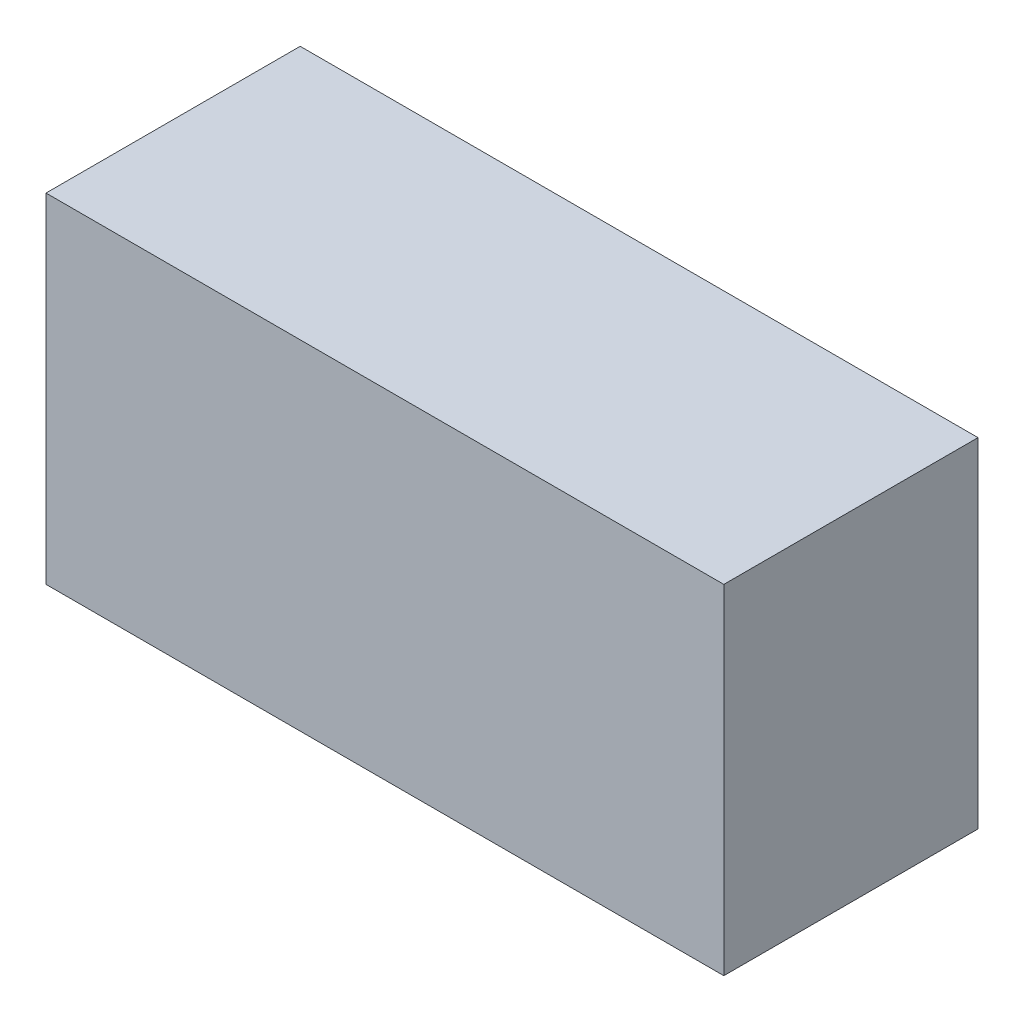
ISO-10303-21;
HEADER;
FILE_DESCRIPTION(('STEP AP214'),'2;1');
FILE_NAME('part.step','',(''),(''),'','','');
FILE_SCHEMA(('AUTOMOTIVE_DESIGN { 1 0 10303 214 1 1 1 1 }'));
ENDSEC;
DATA;
#1=APPLICATION_CONTEXT('core data for automotive mechanical design processes');
#2=APPLICATION_PROTOCOL_DEFINITION('international standard','automotive_design',2000,#1);
#3=PRODUCT_CONTEXT('',#1,'mechanical');
#4=PRODUCT('Part','Part','',(#3));
#5=PRODUCT_RELATED_PRODUCT_CATEGORY('part','',(#4));
#6=PRODUCT_DEFINITION_FORMATION('','',#4);
#7=PRODUCT_DEFINITION_CONTEXT('part definition',#1,'design');
#8=PRODUCT_DEFINITION('design','',#6,#7);
#9=PRODUCT_DEFINITION_SHAPE('','',#8);
#10=(LENGTH_UNIT() NAMED_UNIT(*) SI_UNIT(.MILLI.,.METRE.));
#11=(NAMED_UNIT(*) PLANE_ANGLE_UNIT() SI_UNIT($,.RADIAN.));
#12=(NAMED_UNIT(*) SI_UNIT($,.STERADIAN.) SOLID_ANGLE_UNIT());
#13=UNCERTAINTY_MEASURE_WITH_UNIT(LENGTH_MEASURE(1.E-05),#10,'distance_accuracy_value','');
#14=(GEOMETRIC_REPRESENTATION_CONTEXT(3) GLOBAL_UNCERTAINTY_ASSIGNED_CONTEXT((#13)) GLOBAL_UNIT_ASSIGNED_CONTEXT((#10,
#11,#12)) REPRESENTATION_CONTEXT('',''));
#15=CARTESIAN_POINT('',(0.,0.,0.));
#16=DIRECTION('',(0.,0.,1.));
#17=DIRECTION('',(1.,0.,0.));
#18=AXIS2_PLACEMENT_3D('',#15,#16,#17);
#19=CARTESIAN_POINT('',(20.,-9.99999999999999,15.));
#20=DIRECTION('',(-1.,0.,0.));
#21=DIRECTION('',(0.,0.,1.));
#22=AXIS2_PLACEMENT_3D('',#19,#20,#21);
#23=PLANE('',#22);
#24=DIRECTION('',(0.,1.,0.));
#25=VECTOR('',#24,1.);
#26=CARTESIAN_POINT('',(20.,-9.99999999999999,0.));
#27=LINE('',#26,#25);
#28=CARTESIAN_POINT('',(20.,-9.99999999999999,0.));
#29=VERTEX_POINT('',#28);
#30=CARTESIAN_POINT('',(20.,10.,0.));
#31=VERTEX_POINT('',#30);
#32=EDGE_CURVE('E96',#29,#31,#27,.T.);
#33=ORIENTED_EDGE('',*,*,#32,.T.);
#34=DIRECTION('',(0.,0.,-1.));
#35=VECTOR('',#34,1.);
#36=CARTESIAN_POINT('',(20.,10.,15.));
#37=LINE('',#36,#35);
#38=CARTESIAN_POINT('',(20.,10.,15.));
#39=VERTEX_POINT('',#38);
#40=EDGE_CURVE('E11',#39,#31,#37,.T.);
#41=ORIENTED_EDGE('',*,*,#40,.F.);
#42=DIRECTION('',(0.,1.,0.));
#43=VECTOR('',#42,1.);
#44=CARTESIAN_POINT('',(20.,-9.99999999999999,15.));
#45=LINE('',#44,#43);
#46=CARTESIAN_POINT('',(20.,-9.99999999999999,15.));
#47=VERTEX_POINT('',#46);
#48=EDGE_CURVE('E84',#47,#39,#45,.T.);
#49=ORIENTED_EDGE('',*,*,#48,.F.);
#50=DIRECTION('',(0.,0.,-1.));
#51=VECTOR('',#50,1.);
#52=CARTESIAN_POINT('',(20.,-9.99999999999999,15.));
#53=LINE('',#52,#51);
#54=EDGE_CURVE('E92',#47,#29,#53,.T.);
#55=ORIENTED_EDGE('',*,*,#54,.T.);
#56=EDGE_LOOP('',(#33,#41,#49,#55));
#57=FACE_BOUND('',#56,.T.);
#58=ADVANCED_FACE('F33',(#57),#23,.F.);
#59=CARTESIAN_POINT('',(-20.,10.,15.));
#60=DIRECTION('',(0.,-1.,0.));
#61=DIRECTION('',(0.,0.,-1.));
#62=AXIS2_PLACEMENT_3D('',#59,#60,#61);
#63=PLANE('',#62);
#64=DIRECTION('',(-1.,0.,0.));
#65=VECTOR('',#64,1.);
#66=CARTESIAN_POINT('',(-20.,10.,0.));
#67=LINE('',#66,#65);
#68=CARTESIAN_POINT('',(-20.,10.,0.));
#69=VERTEX_POINT('',#68);
#70=EDGE_CURVE('E88',#31,#69,#67,.T.);
#71=ORIENTED_EDGE('',*,*,#70,.T.);
#72=DIRECTION('',(0.,0.,-1.));
#73=VECTOR('',#72,1.);
#74=CARTESIAN_POINT('',(-20.,10.,15.));
#75=LINE('',#74,#73);
#76=CARTESIAN_POINT('',(-20.,10.,15.));
#77=VERTEX_POINT('',#76);
#78=EDGE_CURVE('E41',#77,#69,#75,.T.);
#79=ORIENTED_EDGE('',*,*,#78,.F.);
#80=DIRECTION('',(-1.,0.,0.));
#81=VECTOR('',#80,1.);
#82=CARTESIAN_POINT('',(-20.,10.,15.));
#83=LINE('',#82,#81);
#84=EDGE_CURVE('E79',#39,#77,#83,.T.);
#85=ORIENTED_EDGE('',*,*,#84,.F.);
#86=ORIENTED_EDGE('',*,*,#40,.T.);
#87=EDGE_LOOP('',(#71,#79,#85,#86));
#88=FACE_BOUND('',#87,.T.);
#89=ADVANCED_FACE('F87',(#88),#63,.F.);
#90=CARTESIAN_POINT('',(-20.,-9.99999999999999,15.));
#91=DIRECTION('',(1.,0.,0.));
#92=DIRECTION('',(0.,0.,-1.));
#93=AXIS2_PLACEMENT_3D('',#90,#91,#92);
#94=PLANE('',#93);
#95=DIRECTION('',(0.,-1.,0.));
#96=VECTOR('',#95,1.);
#97=CARTESIAN_POINT('',(-20.,-9.99999999999999,0.));
#98=LINE('',#97,#96);
#99=CARTESIAN_POINT('',(-20.,-9.99999999999999,0.));
#100=VERTEX_POINT('',#99);
#101=EDGE_CURVE('E66',#69,#100,#98,.T.);
#102=ORIENTED_EDGE('',*,*,#101,.T.);
#103=DIRECTION('',(0.,0.,-1.));
#104=VECTOR('',#103,1.);
#105=CARTESIAN_POINT('',(-20.,-9.99999999999999,15.));
#106=LINE('',#105,#104);
#107=CARTESIAN_POINT('',(-20.,-9.99999999999999,15.));
#108=VERTEX_POINT('',#107);
#109=EDGE_CURVE('E89',#108,#100,#106,.T.);
#110=ORIENTED_EDGE('',*,*,#109,.F.);
#111=DIRECTION('',(0.,-1.,0.));
#112=VECTOR('',#111,1.);
#113=CARTESIAN_POINT('',(-20.,-9.99999999999999,15.));
#114=LINE('',#113,#112);
#115=EDGE_CURVE('E82',#77,#108,#114,.T.);
#116=ORIENTED_EDGE('',*,*,#115,.F.);
#117=ORIENTED_EDGE('',*,*,#78,.T.);
#118=EDGE_LOOP('',(#102,#110,#116,#117));
#119=FACE_BOUND('',#118,.T.);
#120=ADVANCED_FACE('F90',(#119),#94,.F.);
#121=CARTESIAN_POINT('',(-20.,-9.99999999999999,15.));
#122=DIRECTION('',(0.,1.,0.));
#123=DIRECTION('',(0.,0.,1.));
#124=AXIS2_PLACEMENT_3D('',#121,#122,#123);
#125=PLANE('',#124);
#126=DIRECTION('',(1.,0.,0.));
#127=VECTOR('',#126,1.);
#128=CARTESIAN_POINT('',(-20.,-9.99999999999999,0.));
#129=LINE('',#128,#127);
#130=EDGE_CURVE('E72',#100,#29,#129,.T.);
#131=ORIENTED_EDGE('',*,*,#130,.T.);
#132=ORIENTED_EDGE('',*,*,#54,.F.);
#133=DIRECTION('',(1.,0.,0.));
#134=VECTOR('',#133,1.);
#135=CARTESIAN_POINT('',(-20.,-9.99999999999999,15.));
#136=LINE('',#135,#134);
#137=EDGE_CURVE('E49',#108,#47,#136,.T.);
#138=ORIENTED_EDGE('',*,*,#137,.F.);
#139=ORIENTED_EDGE('',*,*,#109,.T.);
#140=EDGE_LOOP('',(#131,#132,#138,#139));
#141=FACE_BOUND('',#140,.T.);
#142=ADVANCED_FACE('F103',(#141),#125,.F.);
#143=CARTESIAN_POINT('',(20.,10.,15.));
#144=DIRECTION('',(0.,0.,-1.));
#145=DIRECTION('',(-1.,0.,0.));
#146=AXIS2_PLACEMENT_3D('',#143,#144,#145);
#147=PLANE('',#146);
#148=ORIENTED_EDGE('',*,*,#48,.T.);
#149=ORIENTED_EDGE('',*,*,#84,.T.);
#150=ORIENTED_EDGE('',*,*,#115,.T.);
#151=ORIENTED_EDGE('',*,*,#137,.T.);
#152=EDGE_LOOP('',(#148,#149,#150,#151));
#153=FACE_BOUND('',#152,.T.);
#154=ADVANCED_FACE('F80',(#153),#147,.F.);
#155=CARTESIAN_POINT('',(20.,10.,0.));
#156=DIRECTION('',(0.,0.,-1.));
#157=DIRECTION('',(-1.,0.,0.));
#158=AXIS2_PLACEMENT_3D('',#155,#156,#157);
#159=PLANE('',#158);
#160=ORIENTED_EDGE('',*,*,#32,.F.);
#161=ORIENTED_EDGE('',*,*,#130,.F.);
#162=ORIENTED_EDGE('',*,*,#101,.F.);
#163=ORIENTED_EDGE('',*,*,#70,.F.);
#164=EDGE_LOOP('',(#160,#161,#162,#163));
#165=FACE_BOUND('',#164,.T.);
#166=ADVANCED_FACE('F106',(#165),#159,.T.);
#167=CLOSED_SHELL('',(#58,#89,#120,#142,#154,#166));
#168=MANIFOLD_SOLID_BREP('B2',#167);
#169=ADVANCED_BREP_SHAPE_REPRESENTATION('',(#18,#168),#14);
#170=SHAPE_DEFINITION_REPRESENTATION(#9,#169);
ENDSEC;
END-ISO-10303-21;
